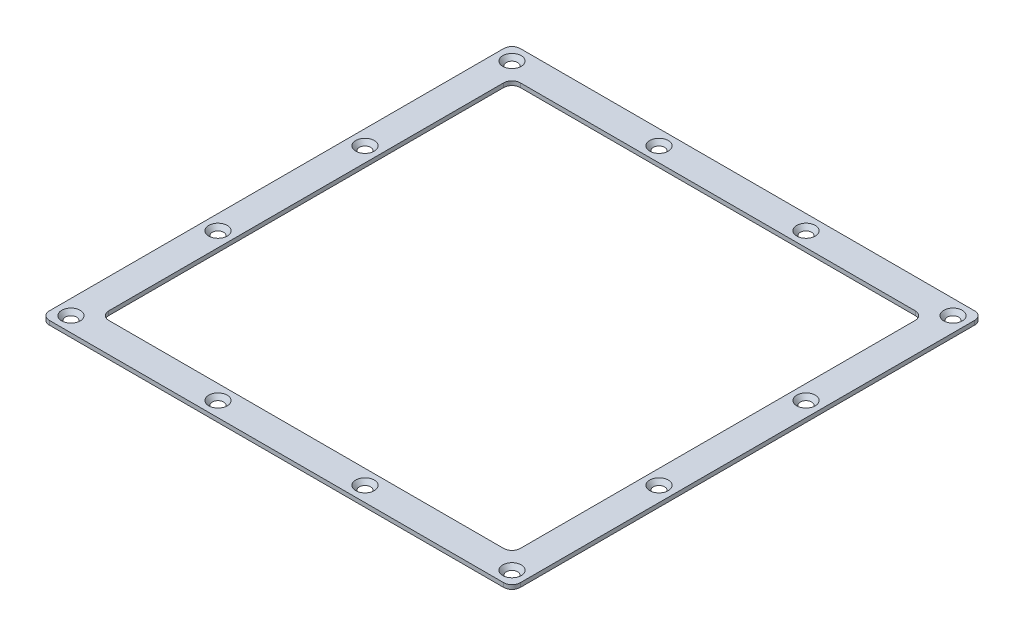
ISO-10303-21;
HEADER;
FILE_DESCRIPTION(('STEP AP214'),'2;1');
FILE_NAME('part.step','',(''),(''),'','','');
FILE_SCHEMA(('AUTOMOTIVE_DESIGN { 1 0 10303 214 1 1 1 1 }'));
ENDSEC;
DATA;
#1=APPLICATION_CONTEXT('core data for automotive mechanical design processes');
#2=APPLICATION_PROTOCOL_DEFINITION('international standard','automotive_design',2000,#1);
#3=PRODUCT_CONTEXT('',#1,'mechanical');
#4=PRODUCT('Part','Part','',(#3));
#5=PRODUCT_RELATED_PRODUCT_CATEGORY('part','',(#4));
#6=PRODUCT_DEFINITION_FORMATION('','',#4);
#7=PRODUCT_DEFINITION_CONTEXT('part definition',#1,'design');
#8=PRODUCT_DEFINITION('design','',#6,#7);
#9=PRODUCT_DEFINITION_SHAPE('','',#8);
#10=(LENGTH_UNIT() NAMED_UNIT(*) SI_UNIT(.MILLI.,.METRE.));
#11=(NAMED_UNIT(*) PLANE_ANGLE_UNIT() SI_UNIT($,.RADIAN.));
#12=(NAMED_UNIT(*) SI_UNIT($,.STERADIAN.) SOLID_ANGLE_UNIT());
#13=UNCERTAINTY_MEASURE_WITH_UNIT(LENGTH_MEASURE(1.E-05),#10,'distance_accuracy_value','');
#14=(GEOMETRIC_REPRESENTATION_CONTEXT(3) GLOBAL_UNCERTAINTY_ASSIGNED_CONTEXT((#13)) GLOBAL_UNIT_ASSIGNED_CONTEXT((#10,
#11,#12)) REPRESENTATION_CONTEXT('',''));
#15=CARTESIAN_POINT('',(0.,0.,0.));
#16=DIRECTION('',(0.,0.,1.));
#17=DIRECTION('',(1.,0.,0.));
#18=AXIS2_PLACEMENT_3D('',#15,#16,#17);
#19=CARTESIAN_POINT('',(177.038,-1.5875,-3.175));
#20=DIRECTION('',(0.,-1.,0.));
#21=DIRECTION('',(0.,0.,-1.));
#22=AXIS2_PLACEMENT_3D('',#19,#20,#21);
#23=PLANE('',#22);
#24=CARTESIAN_POINT('',(5.715,-1.5875,-174.4979492));
#25=DIRECTION('',(0.,-1.,0.));
#26=DIRECTION('',(0.,0.,-1.));
#27=AXIS2_PLACEMENT_3D('',#24,#25,#26);
#28=CIRCLE('',#27,2.16330730371674);
#29=CARTESIAN_POINT('',(5.715,-1.5875,-176.661256503717));
#30=VERTEX_POINT('',#29);
#31=EDGE_CURVE('E482',#30,#30,#28,.T.);
#32=ORIENTED_EDGE('',*,*,#31,.F.);
#33=EDGE_LOOP('',(#32));
#34=FACE_BOUND('',#33,.T.);
#35=CARTESIAN_POINT('',(61.976,-1.5875,-174.4979492));
#36=DIRECTION('',(0.,-1.,0.));
#37=DIRECTION('',(0.,0.,-1.));
#38=AXIS2_PLACEMENT_3D('',#35,#36,#37);
#39=CIRCLE('',#38,2.16330730371674);
#40=CARTESIAN_POINT('',(61.976,-1.5875,-176.661256503717));
#41=VERTEX_POINT('',#40);
#42=EDGE_CURVE('E478',#41,#41,#39,.T.);
#43=ORIENTED_EDGE('',*,*,#42,.F.);
#44=EDGE_LOOP('',(#43));
#45=FACE_BOUND('',#44,.T.);
#46=CARTESIAN_POINT('',(61.976,-1.5875,-5.7149492));
#47=DIRECTION('',(0.,-1.,0.));
#48=DIRECTION('',(0.,0.,-1.));
#49=AXIS2_PLACEMENT_3D('',#46,#47,#48);
#50=CIRCLE('',#49,2.16330730371674);
#51=CARTESIAN_POINT('',(61.976,-1.5875,-7.87825650371675));
#52=VERTEX_POINT('',#51);
#53=EDGE_CURVE('E474',#52,#52,#50,.T.);
#54=ORIENTED_EDGE('',*,*,#53,.F.);
#55=EDGE_LOOP('',(#54));
#56=FACE_BOUND('',#55,.T.);
#57=CARTESIAN_POINT('',(5.71500000000001,-1.5875,-5.7149492));
#58=DIRECTION('',(0.,-1.,0.));
#59=DIRECTION('',(0.,0.,-1.));
#60=AXIS2_PLACEMENT_3D('',#57,#58,#59);
#61=CIRCLE('',#60,2.16330730371674);
#62=CARTESIAN_POINT('',(5.71500000000001,-1.5875,-7.87825650371674));
#63=VERTEX_POINT('',#62);
#64=EDGE_CURVE('E470',#63,#63,#61,.T.);
#65=ORIENTED_EDGE('',*,*,#64,.F.);
#66=EDGE_LOOP('',(#65));
#67=FACE_BOUND('',#66,.T.);
#68=CARTESIAN_POINT('',(174.498,-1.5875,-61.9759492));
#69=DIRECTION('',(0.,-1.,0.));
#70=DIRECTION('',(0.,0.,-1.));
#71=AXIS2_PLACEMENT_3D('',#68,#69,#70);
#72=CIRCLE('',#71,2.16330730371673);
#73=CARTESIAN_POINT('',(174.498,-1.5875,-64.1392565037167));
#74=VERTEX_POINT('',#73);
#75=EDGE_CURVE('E446',#74,#74,#72,.T.);
#76=ORIENTED_EDGE('',*,*,#75,.F.);
#77=EDGE_LOOP('',(#76));
#78=FACE_BOUND('',#77,.T.);
#79=CARTESIAN_POINT('',(118.237,-1.5875,-5.7149492));
#80=DIRECTION('',(0.,-1.,0.));
#81=DIRECTION('',(0.,0.,-1.));
#82=AXIS2_PLACEMENT_3D('',#79,#80,#81);
#83=CIRCLE('',#82,2.16330730371674);
#84=CARTESIAN_POINT('',(118.237,-1.5875,-7.87825650371675));
#85=VERTEX_POINT('',#84);
#86=EDGE_CURVE('E441',#85,#85,#83,.T.);
#87=ORIENTED_EDGE('',*,*,#86,.F.);
#88=EDGE_LOOP('',(#87));
#89=FACE_BOUND('',#88,.T.);
#90=CARTESIAN_POINT('',(174.498,-1.5875,-5.7149492));
#91=DIRECTION('',(0.,-1.,0.));
#92=DIRECTION('',(0.,0.,-1.));
#93=AXIS2_PLACEMENT_3D('',#90,#91,#92);
#94=CIRCLE('',#93,2.16330730371673);
#95=CARTESIAN_POINT('',(174.498,-1.5875,-7.87825650371673));
#96=VERTEX_POINT('',#95);
#97=EDGE_CURVE('E179',#96,#96,#94,.T.);
#98=ORIENTED_EDGE('',*,*,#97,.F.);
#99=EDGE_LOOP('',(#98));
#100=FACE_BOUND('',#99,.T.);
#101=CARTESIAN_POINT('',(177.038,-1.5875,-3.175));
#102=DIRECTION('',(0.,1.,0.));
#103=DIRECTION('',(0.,0.,-1.));
#104=AXIS2_PLACEMENT_3D('',#101,#102,#103);
#105=CIRCLE('',#104,3.17500000000001);
#106=CARTESIAN_POINT('',(177.038,-1.5875,0.));
#107=VERTEX_POINT('',#106);
#108=CARTESIAN_POINT('',(180.213,-1.5875,-3.175));
#109=VERTEX_POINT('',#108);
#110=EDGE_CURVE('E226',#107,#109,#105,.T.);
#111=ORIENTED_EDGE('',*,*,#110,.F.);
#112=DIRECTION('',(1.,0.,0.));
#113=VECTOR('',#112,1.);
#114=CARTESIAN_POINT('',(3.17500000000002,-1.5875,0.));
#115=LINE('',#114,#113);
#116=CARTESIAN_POINT('',(3.17500000000002,-1.5875,0.));
#117=VERTEX_POINT('',#116);
#118=EDGE_CURVE('E248',#117,#107,#115,.T.);
#119=ORIENTED_EDGE('',*,*,#118,.F.);
#120=CARTESIAN_POINT('',(3.175,-1.5875,-3.175));
#121=DIRECTION('',(0.,1.,0.));
#122=DIRECTION('',(0.,0.,-1.));
#123=AXIS2_PLACEMENT_3D('',#120,#121,#122);
#124=CIRCLE('',#123,3.175);
#125=CARTESIAN_POINT('',(0.,-1.5875,-3.17500000000002));
#126=VERTEX_POINT('',#125);
#127=EDGE_CURVE('E245',#126,#117,#124,.T.);
#128=ORIENTED_EDGE('',*,*,#127,.F.);
#129=DIRECTION('',(0.,0.,1.));
#130=VECTOR('',#129,1.);
#131=CARTESIAN_POINT('',(0.,-1.5875,-3.17500000000002));
#132=LINE('',#131,#130);
#133=CARTESIAN_POINT('',(0.,-1.5875,-177.038));
#134=VERTEX_POINT('',#133);
#135=EDGE_CURVE('E242',#134,#126,#132,.T.);
#136=ORIENTED_EDGE('',*,*,#135,.F.);
#137=CARTESIAN_POINT('',(3.175,-1.5875,-177.038));
#138=DIRECTION('',(0.,1.,0.));
#139=DIRECTION('',(0.,0.,1.));
#140=AXIS2_PLACEMENT_3D('',#137,#138,#139);
#141=CIRCLE('',#140,3.17500000000001);
#142=CARTESIAN_POINT('',(3.175,-1.5875,-180.213));
#143=VERTEX_POINT('',#142);
#144=EDGE_CURVE('E239',#143,#134,#141,.T.);
#145=ORIENTED_EDGE('',*,*,#144,.F.);
#146=DIRECTION('',(-1.,0.,0.));
#147=VECTOR('',#146,1.);
#148=CARTESIAN_POINT('',(3.175,-1.5875,-180.213));
#149=LINE('',#148,#147);
#150=CARTESIAN_POINT('',(177.038,-1.5875,-180.213));
#151=VERTEX_POINT('',#150);
#152=EDGE_CURVE('E236',#151,#143,#149,.T.);
#153=ORIENTED_EDGE('',*,*,#152,.F.);
#154=CARTESIAN_POINT('',(177.038,-1.5875,-177.038));
#155=DIRECTION('',(0.,1.,0.));
#156=DIRECTION('',(0.,0.,1.));
#157=AXIS2_PLACEMENT_3D('',#154,#155,#156);
#158=CIRCLE('',#157,3.17500000000001);
#159=CARTESIAN_POINT('',(180.213,-1.5875,-177.038));
#160=VERTEX_POINT('',#159);
#161=EDGE_CURVE('E233',#160,#151,#158,.T.);
#162=ORIENTED_EDGE('',*,*,#161,.F.);
#163=DIRECTION('',(0.,0.,-1.));
#164=VECTOR('',#163,1.);
#165=CARTESIAN_POINT('',(180.213,-1.5875,-3.175));
#166=LINE('',#165,#164);
#167=EDGE_CURVE('E229',#109,#160,#166,.T.);
#168=ORIENTED_EDGE('',*,*,#167,.F.);
#169=EDGE_LOOP('',(#111,#119,#128,#136,#145,#153,#162,#168));
#170=FACE_BOUND('',#169,.T.);
#171=CARTESIAN_POINT('',(14.5288,-1.5875,-165.6842));
#172=DIRECTION('',(0.,1.,0.));
#173=DIRECTION('',(0.,0.,1.));
#174=AXIS2_PLACEMENT_3D('',#171,#172,#173);
#175=CIRCLE('',#174,3.17500000000001);
#176=CARTESIAN_POINT('',(14.5288,-1.5875,-168.8592));
#177=VERTEX_POINT('',#176);
#178=CARTESIAN_POINT('',(11.3538,-1.5875,-165.6842));
#179=VERTEX_POINT('',#178);
#180=EDGE_CURVE('E157',#177,#179,#175,.T.);
#181=ORIENTED_EDGE('',*,*,#180,.T.);
#182=DIRECTION('',(0.,0.,1.));
#183=VECTOR('',#182,1.);
#184=CARTESIAN_POINT('',(11.3538,-1.5875,-165.6842));
#185=LINE('',#184,#183);
#186=CARTESIAN_POINT('',(11.3538,-1.5875,-14.5288));
#187=VERTEX_POINT('',#186);
#188=EDGE_CURVE('E166',#179,#187,#185,.T.);
#189=ORIENTED_EDGE('',*,*,#188,.T.);
#190=CARTESIAN_POINT('',(14.5288,-1.5875,-14.5288));
#191=DIRECTION('',(0.,1.,0.));
#192=DIRECTION('',(0.,0.,1.));
#193=AXIS2_PLACEMENT_3D('',#190,#191,#192);
#194=CIRCLE('',#193,3.175);
#195=CARTESIAN_POINT('',(14.5288,-1.5875,-11.3538));
#196=VERTEX_POINT('',#195);
#197=EDGE_CURVE('E58',#187,#196,#194,.T.);
#198=ORIENTED_EDGE('',*,*,#197,.T.);
#199=DIRECTION('',(1.,0.,0.));
#200=VECTOR('',#199,1.);
#201=CARTESIAN_POINT('',(14.5288,-1.5875,-11.3538));
#202=LINE('',#201,#200);
#203=CARTESIAN_POINT('',(165.6842,-1.5875,-11.3538));
#204=VERTEX_POINT('',#203);
#205=EDGE_CURVE('E183',#196,#204,#202,.T.);
#206=ORIENTED_EDGE('',*,*,#205,.T.);
#207=CARTESIAN_POINT('',(165.6842,-1.5875,-14.5288));
#208=DIRECTION('',(0.,1.,0.));
#209=DIRECTION('',(0.,0.,1.));
#210=AXIS2_PLACEMENT_3D('',#207,#208,#209);
#211=CIRCLE('',#210,3.17500000000002);
#212=CARTESIAN_POINT('',(168.8592,-1.5875,-14.5288));
#213=VERTEX_POINT('',#212);
#214=EDGE_CURVE('E186',#204,#213,#211,.T.);
#215=ORIENTED_EDGE('',*,*,#214,.T.);
#216=DIRECTION('',(0.,0.,-1.));
#217=VECTOR('',#216,1.);
#218=CARTESIAN_POINT('',(168.8592,-1.5875,-165.6842));
#219=LINE('',#218,#217);
#220=CARTESIAN_POINT('',(168.8592,-1.5875,-165.6842));
#221=VERTEX_POINT('',#220);
#222=EDGE_CURVE('E189',#213,#221,#219,.T.);
#223=ORIENTED_EDGE('',*,*,#222,.T.);
#224=CARTESIAN_POINT('',(165.6842,-1.5875,-165.6842));
#225=DIRECTION('',(0.,1.,0.));
#226=DIRECTION('',(0.,0.,-1.));
#227=AXIS2_PLACEMENT_3D('',#224,#225,#226);
#228=CIRCLE('',#227,3.17500000000001);
#229=CARTESIAN_POINT('',(165.6842,-1.5875,-168.8592));
#230=VERTEX_POINT('',#229);
#231=EDGE_CURVE('E192',#221,#230,#228,.T.);
#232=ORIENTED_EDGE('',*,*,#231,.T.);
#233=DIRECTION('',(-1.,0.,0.));
#234=VECTOR('',#233,1.);
#235=CARTESIAN_POINT('',(14.5288,-1.5875,-168.8592));
#236=LINE('',#235,#234);
#237=EDGE_CURVE('E163',#230,#177,#236,.T.);
#238=ORIENTED_EDGE('',*,*,#237,.T.);
#239=EDGE_LOOP('',(#181,#189,#198,#206,#215,#223,#232,#238));
#240=FACE_BOUND('',#239,.T.);
#241=CARTESIAN_POINT('',(174.498,-1.5875,-118.2369492));
#242=DIRECTION('',(0.,-1.,0.));
#243=DIRECTION('',(0.,0.,-1.));
#244=AXIS2_PLACEMENT_3D('',#241,#242,#243);
#245=CIRCLE('',#244,2.16330730371673);
#246=CARTESIAN_POINT('',(174.498,-1.5875,-120.400256503717));
#247=VERTEX_POINT('',#246);
#248=EDGE_CURVE('E450',#247,#247,#245,.T.);
#249=ORIENTED_EDGE('',*,*,#248,.F.);
#250=EDGE_LOOP('',(#249));
#251=FACE_BOUND('',#250,.T.);
#252=CARTESIAN_POINT('',(174.498,-1.5875,-174.4979492));
#253=DIRECTION('',(0.,-1.,0.));
#254=DIRECTION('',(0.,0.,-1.));
#255=AXIS2_PLACEMENT_3D('',#252,#253,#254);
#256=CIRCLE('',#255,2.16330730371673);
#257=CARTESIAN_POINT('',(174.498,-1.5875,-176.661256503717));
#258=VERTEX_POINT('',#257);
#259=EDGE_CURVE('E454',#258,#258,#256,.T.);
#260=ORIENTED_EDGE('',*,*,#259,.F.);
#261=EDGE_LOOP('',(#260));
#262=FACE_BOUND('',#261,.T.);
#263=CARTESIAN_POINT('',(118.237,-1.5875,-174.4979492));
#264=DIRECTION('',(0.,-1.,0.));
#265=DIRECTION('',(0.,0.,-1.));
#266=AXIS2_PLACEMENT_3D('',#263,#264,#265);
#267=CIRCLE('',#266,2.16330730371674);
#268=CARTESIAN_POINT('',(118.237,-1.5875,-176.661256503717));
#269=VERTEX_POINT('',#268);
#270=EDGE_CURVE('E458',#269,#269,#267,.T.);
#271=ORIENTED_EDGE('',*,*,#270,.F.);
#272=EDGE_LOOP('',(#271));
#273=FACE_BOUND('',#272,.T.);
#274=CARTESIAN_POINT('',(5.71500000000001,-1.5875,-118.2369492));
#275=DIRECTION('',(0.,-1.,0.));
#276=DIRECTION('',(0.,0.,-1.));
#277=AXIS2_PLACEMENT_3D('',#274,#275,#276);
#278=CIRCLE('',#277,2.16330730371674);
#279=CARTESIAN_POINT('',(5.71500000000001,-1.5875,-120.400256503717));
#280=VERTEX_POINT('',#279);
#281=EDGE_CURVE('E462',#280,#280,#278,.T.);
#282=ORIENTED_EDGE('',*,*,#281,.F.);
#283=EDGE_LOOP('',(#282));
#284=FACE_BOUND('',#283,.T.);
#285=CARTESIAN_POINT('',(5.71499999999999,-1.5875,-61.9759492));
#286=DIRECTION('',(0.,-1.,0.));
#287=DIRECTION('',(0.,0.,-1.));
#288=AXIS2_PLACEMENT_3D('',#285,#286,#287);
#289=CIRCLE('',#288,2.16330730371674);
#290=CARTESIAN_POINT('',(5.71499999999999,-1.5875,-64.1392565037167));
#291=VERTEX_POINT('',#290);
#292=EDGE_CURVE('E466',#291,#291,#289,.T.);
#293=ORIENTED_EDGE('',*,*,#292,.F.);
#294=EDGE_LOOP('',(#293));
#295=FACE_BOUND('',#294,.T.);
#296=ADVANCED_FACE('F41',(#34,#45,#56,#67,#78,#89,#100,#170,#240,#251,#262,#273,#284,#295),#23,.T.);
#297=CARTESIAN_POINT('',(177.038,-1.5875,-3.175));
#298=DIRECTION('',(0.,1.,0.));
#299=DIRECTION('',(0.,0.,1.));
#300=AXIS2_PLACEMENT_3D('',#297,#298,#299);
#301=CYLINDRICAL_SURFACE('',#300,3.17500000000001);
#302=CARTESIAN_POINT('',(177.038,0.,-3.175));
#303=DIRECTION('',(0.,1.,0.));
#304=DIRECTION('',(0.,0.,-1.));
#305=AXIS2_PLACEMENT_3D('',#302,#303,#304);
#306=CIRCLE('',#305,3.17500000000001);
#307=CARTESIAN_POINT('',(177.038,0.,0.));
#308=VERTEX_POINT('',#307);
#309=CARTESIAN_POINT('',(180.213,0.,-3.175));
#310=VERTEX_POINT('',#309);
#311=EDGE_CURVE('E214',#308,#310,#306,.T.);
#312=ORIENTED_EDGE('',*,*,#311,.F.);
#313=DIRECTION('',(0.,1.,0.));
#314=VECTOR('',#313,1.);
#315=CARTESIAN_POINT('',(177.038,-1.5875,0.));
#316=LINE('',#315,#314);
#317=EDGE_CURVE('E11',#107,#308,#316,.T.);
#318=ORIENTED_EDGE('',*,*,#317,.F.);
#319=ORIENTED_EDGE('',*,*,#110,.T.);
#320=DIRECTION('',(0.,1.,0.));
#321=VECTOR('',#320,1.);
#322=CARTESIAN_POINT('',(180.213,-1.5875,-3.175));
#323=LINE('',#322,#321);
#324=EDGE_CURVE('E45',#109,#310,#323,.T.);
#325=ORIENTED_EDGE('',*,*,#324,.T.);
#326=EDGE_LOOP('',(#312,#318,#319,#325));
#327=FACE_BOUND('',#326,.T.);
#328=ADVANCED_FACE('F43',(#327),#301,.T.);
#329=CARTESIAN_POINT('',(3.17500000000002,-1.5875,0.));
#330=DIRECTION('',(0.,0.,1.));
#331=DIRECTION('',(1.,0.,0.));
#332=AXIS2_PLACEMENT_3D('',#329,#330,#331);
#333=PLANE('',#332);
#334=DIRECTION('',(1.,0.,0.));
#335=VECTOR('',#334,1.);
#336=CARTESIAN_POINT('',(3.17500000000002,0.,0.));
#337=LINE('',#336,#335);
#338=CARTESIAN_POINT('',(3.17500000000002,0.,0.));
#339=VERTEX_POINT('',#338);
#340=EDGE_CURVE('E230',#339,#308,#337,.T.);
#341=ORIENTED_EDGE('',*,*,#340,.F.);
#342=DIRECTION('',(0.,1.,0.));
#343=VECTOR('',#342,1.);
#344=CARTESIAN_POINT('',(3.17500000000002,-1.5875,0.));
#345=LINE('',#344,#343);
#346=EDGE_CURVE('E50',#117,#339,#345,.T.);
#347=ORIENTED_EDGE('',*,*,#346,.F.);
#348=ORIENTED_EDGE('',*,*,#118,.T.);
#349=ORIENTED_EDGE('',*,*,#317,.T.);
#350=EDGE_LOOP('',(#341,#347,#348,#349));
#351=FACE_BOUND('',#350,.T.);
#352=ADVANCED_FACE('F295',(#351),#333,.T.);
#353=CARTESIAN_POINT('',(3.175,-1.5875,-3.175));
#354=DIRECTION('',(0.,1.,0.));
#355=DIRECTION('',(0.,0.,1.));
#356=AXIS2_PLACEMENT_3D('',#353,#354,#355);
#357=CYLINDRICAL_SURFACE('',#356,3.175);
#358=CARTESIAN_POINT('',(3.175,0.,-3.175));
#359=DIRECTION('',(0.,1.,0.));
#360=DIRECTION('',(0.,0.,-1.));
#361=AXIS2_PLACEMENT_3D('',#358,#359,#360);
#362=CIRCLE('',#361,3.175);
#363=CARTESIAN_POINT('',(0.,0.,-3.17500000000002));
#364=VERTEX_POINT('',#363);
#365=EDGE_CURVE('E268',#364,#339,#362,.T.);
#366=ORIENTED_EDGE('',*,*,#365,.F.);
#367=DIRECTION('',(0.,1.,0.));
#368=VECTOR('',#367,1.);
#369=CARTESIAN_POINT('',(0.,-1.5875,-3.17500000000002));
#370=LINE('',#369,#368);
#371=EDGE_CURVE('E274',#126,#364,#370,.T.);
#372=ORIENTED_EDGE('',*,*,#371,.F.);
#373=ORIENTED_EDGE('',*,*,#127,.T.);
#374=ORIENTED_EDGE('',*,*,#346,.T.);
#375=EDGE_LOOP('',(#366,#372,#373,#374));
#376=FACE_BOUND('',#375,.T.);
#377=ADVANCED_FACE('F315',(#376),#357,.T.);
#378=CARTESIAN_POINT('',(0.,-1.5875,-3.17500000000002));
#379=DIRECTION('',(-1.,0.,0.));
#380=DIRECTION('',(0.,0.,1.));
#381=AXIS2_PLACEMENT_3D('',#378,#379,#380);
#382=PLANE('',#381);
#383=DIRECTION('',(0.,0.,1.));
#384=VECTOR('',#383,1.);
#385=CARTESIAN_POINT('',(0.,0.,-3.17500000000002));
#386=LINE('',#385,#384);
#387=CARTESIAN_POINT('',(0.,0.,-177.038));
#388=VERTEX_POINT('',#387);
#389=EDGE_CURVE('E265',#388,#364,#386,.T.);
#390=ORIENTED_EDGE('',*,*,#389,.F.);
#391=DIRECTION('',(0.,1.,0.));
#392=VECTOR('',#391,1.);
#393=CARTESIAN_POINT('',(0.,-1.5875,-177.038));
#394=LINE('',#393,#392);
#395=EDGE_CURVE('E276',#134,#388,#394,.T.);
#396=ORIENTED_EDGE('',*,*,#395,.F.);
#397=ORIENTED_EDGE('',*,*,#135,.T.);
#398=ORIENTED_EDGE('',*,*,#371,.T.);
#399=EDGE_LOOP('',(#390,#396,#397,#398));
#400=FACE_BOUND('',#399,.T.);
#401=ADVANCED_FACE('F313',(#400),#382,.T.);
#402=CARTESIAN_POINT('',(3.175,-1.5875,-177.038));
#403=DIRECTION('',(0.,1.,0.));
#404=DIRECTION('',(0.,0.,1.));
#405=AXIS2_PLACEMENT_3D('',#402,#403,#404);
#406=CYLINDRICAL_SURFACE('',#405,3.17500000000001);
#407=CARTESIAN_POINT('',(3.175,0.,-177.038));
#408=DIRECTION('',(0.,1.,0.));
#409=DIRECTION('',(0.,0.,1.));
#410=AXIS2_PLACEMENT_3D('',#407,#408,#409);
#411=CIRCLE('',#410,3.17500000000001);
#412=CARTESIAN_POINT('',(3.175,0.,-180.213));
#413=VERTEX_POINT('',#412);
#414=EDGE_CURVE('E262',#413,#388,#411,.T.);
#415=ORIENTED_EDGE('',*,*,#414,.F.);
#416=DIRECTION('',(0.,1.,0.));
#417=VECTOR('',#416,1.);
#418=CARTESIAN_POINT('',(3.175,-1.5875,-180.213));
#419=LINE('',#418,#417);
#420=EDGE_CURVE('E278',#143,#413,#419,.T.);
#421=ORIENTED_EDGE('',*,*,#420,.F.);
#422=ORIENTED_EDGE('',*,*,#144,.T.);
#423=ORIENTED_EDGE('',*,*,#395,.T.);
#424=EDGE_LOOP('',(#415,#421,#422,#423));
#425=FACE_BOUND('',#424,.T.);
#426=ADVANCED_FACE('F309',(#425),#406,.T.);
#427=CARTESIAN_POINT('',(3.175,-1.5875,-180.213));
#428=DIRECTION('',(0.,0.,-1.));
#429=DIRECTION('',(-1.,0.,0.));
#430=AXIS2_PLACEMENT_3D('',#427,#428,#429);
#431=PLANE('',#430);
#432=DIRECTION('',(-1.,0.,0.));
#433=VECTOR('',#432,1.);
#434=CARTESIAN_POINT('',(3.175,0.,-180.213));
#435=LINE('',#434,#433);
#436=CARTESIAN_POINT('',(177.038,0.,-180.213));
#437=VERTEX_POINT('',#436);
#438=EDGE_CURVE('E259',#437,#413,#435,.T.);
#439=ORIENTED_EDGE('',*,*,#438,.F.);
#440=DIRECTION('',(0.,1.,0.));
#441=VECTOR('',#440,1.);
#442=CARTESIAN_POINT('',(177.038,-1.5875,-180.213));
#443=LINE('',#442,#441);
#444=EDGE_CURVE('E280',#151,#437,#443,.T.);
#445=ORIENTED_EDGE('',*,*,#444,.F.);
#446=ORIENTED_EDGE('',*,*,#152,.T.);
#447=ORIENTED_EDGE('',*,*,#420,.T.);
#448=EDGE_LOOP('',(#439,#445,#446,#447));
#449=FACE_BOUND('',#448,.T.);
#450=ADVANCED_FACE('F307',(#449),#431,.T.);
#451=CARTESIAN_POINT('',(177.038,-1.5875,-177.038));
#452=DIRECTION('',(0.,1.,0.));
#453=DIRECTION('',(0.,0.,1.));
#454=AXIS2_PLACEMENT_3D('',#451,#452,#453);
#455=CYLINDRICAL_SURFACE('',#454,3.17500000000001);
#456=CARTESIAN_POINT('',(177.038,0.,-177.038));
#457=DIRECTION('',(0.,1.,0.));
#458=DIRECTION('',(0.,0.,1.));
#459=AXIS2_PLACEMENT_3D('',#456,#457,#458);
#460=CIRCLE('',#459,3.17500000000001);
#461=CARTESIAN_POINT('',(180.213,0.,-177.038));
#462=VERTEX_POINT('',#461);
#463=EDGE_CURVE('E256',#462,#437,#460,.T.);
#464=ORIENTED_EDGE('',*,*,#463,.F.);
#465=DIRECTION('',(0.,1.,0.));
#466=VECTOR('',#465,1.);
#467=CARTESIAN_POINT('',(180.213,-1.5875,-177.038));
#468=LINE('',#467,#466);
#469=EDGE_CURVE('E281',#160,#462,#468,.T.);
#470=ORIENTED_EDGE('',*,*,#469,.F.);
#471=ORIENTED_EDGE('',*,*,#161,.T.);
#472=ORIENTED_EDGE('',*,*,#444,.T.);
#473=EDGE_LOOP('',(#464,#470,#471,#472));
#474=FACE_BOUND('',#473,.T.);
#475=ADVANCED_FACE('F303',(#474),#455,.T.);
#476=CARTESIAN_POINT('',(180.213,-1.5875,-3.175));
#477=DIRECTION('',(1.,0.,0.));
#478=DIRECTION('',(0.,0.,-1.));
#479=AXIS2_PLACEMENT_3D('',#476,#477,#478);
#480=PLANE('',#479);
#481=DIRECTION('',(0.,0.,-1.));
#482=VECTOR('',#481,1.);
#483=CARTESIAN_POINT('',(180.213,0.,-3.175));
#484=LINE('',#483,#482);
#485=EDGE_CURVE('E253',#310,#462,#484,.T.);
#486=ORIENTED_EDGE('',*,*,#485,.F.);
#487=ORIENTED_EDGE('',*,*,#324,.F.);
#488=ORIENTED_EDGE('',*,*,#167,.T.);
#489=ORIENTED_EDGE('',*,*,#469,.T.);
#490=EDGE_LOOP('',(#486,#487,#488,#489));
#491=FACE_BOUND('',#490,.T.);
#492=ADVANCED_FACE('F289',(#491),#480,.T.);
#493=CARTESIAN_POINT('',(177.038,0.,-3.175));
#494=DIRECTION('',(0.,-1.,0.));
#495=DIRECTION('',(0.,0.,-1.));
#496=AXIS2_PLACEMENT_3D('',#493,#494,#495);
#497=PLANE('',#496);
#498=CARTESIAN_POINT('',(5.715,0.,-174.4979492));
#499=DIRECTION('',(0.,1.,0.));
#500=DIRECTION('',(0.,0.,1.));
#501=AXIS2_PLACEMENT_3D('',#498,#499,#500);
#502=CIRCLE('',#501,3.5433);
#503=CARTESIAN_POINT('',(5.715,0.,-170.9546492));
#504=VERTEX_POINT('',#503);
#505=EDGE_CURVE('E345',#504,#504,#502,.T.);
#506=ORIENTED_EDGE('',*,*,#505,.F.);
#507=EDGE_LOOP('',(#506));
#508=FACE_BOUND('',#507,.T.);
#509=CARTESIAN_POINT('',(61.976,0.,-174.4979492));
#510=DIRECTION('',(0.,1.,0.));
#511=DIRECTION('',(0.,0.,1.));
#512=AXIS2_PLACEMENT_3D('',#509,#510,#511);
#513=CIRCLE('',#512,3.5433);
#514=CARTESIAN_POINT('',(61.976,0.,-170.9546492));
#515=VERTEX_POINT('',#514);
#516=EDGE_CURVE('E349',#515,#515,#513,.T.);
#517=ORIENTED_EDGE('',*,*,#516,.F.);
#518=EDGE_LOOP('',(#517));
#519=FACE_BOUND('',#518,.T.);
#520=CARTESIAN_POINT('',(61.976,0.,-5.7149492));
#521=DIRECTION('',(0.,1.,0.));
#522=DIRECTION('',(0.,0.,1.));
#523=AXIS2_PLACEMENT_3D('',#520,#521,#522);
#524=CIRCLE('',#523,3.5433);
#525=CARTESIAN_POINT('',(61.976,0.,-2.17164920000001));
#526=VERTEX_POINT('',#525);
#527=EDGE_CURVE('E353',#526,#526,#524,.T.);
#528=ORIENTED_EDGE('',*,*,#527,.F.);
#529=EDGE_LOOP('',(#528));
#530=FACE_BOUND('',#529,.T.);
#531=CARTESIAN_POINT('',(5.71500000000001,0.,-5.7149492));
#532=DIRECTION('',(0.,1.,0.));
#533=DIRECTION('',(0.,0.,1.));
#534=AXIS2_PLACEMENT_3D('',#531,#532,#533);
#535=CIRCLE('',#534,3.5433);
#536=CARTESIAN_POINT('',(5.71500000000001,0.,-2.1716492));
#537=VERTEX_POINT('',#536);
#538=EDGE_CURVE('E357',#537,#537,#535,.T.);
#539=ORIENTED_EDGE('',*,*,#538,.F.);
#540=EDGE_LOOP('',(#539));
#541=FACE_BOUND('',#540,.T.);
#542=CARTESIAN_POINT('',(5.71499999999999,0.,-61.9759492));
#543=DIRECTION('',(0.,1.,0.));
#544=DIRECTION('',(0.,0.,1.));
#545=AXIS2_PLACEMENT_3D('',#542,#543,#544);
#546=CIRCLE('',#545,3.5433);
#547=CARTESIAN_POINT('',(5.71499999999999,0.,-58.4326492));
#548=VERTEX_POINT('',#547);
#549=EDGE_CURVE('E361',#548,#548,#546,.T.);
#550=ORIENTED_EDGE('',*,*,#549,.F.);
#551=EDGE_LOOP('',(#550));
#552=FACE_BOUND('',#551,.T.);
#553=CARTESIAN_POINT('',(5.71500000000001,0.,-118.2369492));
#554=DIRECTION('',(0.,1.,0.));
#555=DIRECTION('',(0.,0.,1.));
#556=AXIS2_PLACEMENT_3D('',#553,#554,#555);
#557=CIRCLE('',#556,3.5433);
#558=CARTESIAN_POINT('',(5.71500000000001,0.,-114.6936492));
#559=VERTEX_POINT('',#558);
#560=EDGE_CURVE('E365',#559,#559,#557,.T.);
#561=ORIENTED_EDGE('',*,*,#560,.F.);
#562=EDGE_LOOP('',(#561));
#563=FACE_BOUND('',#562,.T.);
#564=CARTESIAN_POINT('',(118.237,0.,-174.4979492));
#565=DIRECTION('',(0.,1.,0.));
#566=DIRECTION('',(0.,0.,1.));
#567=AXIS2_PLACEMENT_3D('',#564,#565,#566);
#568=CIRCLE('',#567,3.5433);
#569=CARTESIAN_POINT('',(118.237,0.,-170.9546492));
#570=VERTEX_POINT('',#569);
#571=EDGE_CURVE('E369',#570,#570,#568,.T.);
#572=ORIENTED_EDGE('',*,*,#571,.F.);
#573=EDGE_LOOP('',(#572));
#574=FACE_BOUND('',#573,.T.);
#575=CARTESIAN_POINT('',(174.498,0.,-174.4979492));
#576=DIRECTION('',(0.,1.,0.));
#577=DIRECTION('',(0.,0.,1.));
#578=AXIS2_PLACEMENT_3D('',#575,#576,#577);
#579=CIRCLE('',#578,3.5433);
#580=CARTESIAN_POINT('',(174.498,0.,-170.9546492));
#581=VERTEX_POINT('',#580);
#582=EDGE_CURVE('E373',#581,#581,#579,.T.);
#583=ORIENTED_EDGE('',*,*,#582,.F.);
#584=EDGE_LOOP('',(#583));
#585=FACE_BOUND('',#584,.T.);
#586=CARTESIAN_POINT('',(174.498,0.,-118.2369492));
#587=DIRECTION('',(0.,1.,0.));
#588=DIRECTION('',(0.,0.,1.));
#589=AXIS2_PLACEMENT_3D('',#586,#587,#588);
#590=CIRCLE('',#589,3.5433);
#591=CARTESIAN_POINT('',(174.498,0.,-114.6936492));
#592=VERTEX_POINT('',#591);
#593=EDGE_CURVE('E377',#592,#592,#590,.T.);
#594=ORIENTED_EDGE('',*,*,#593,.F.);
#595=EDGE_LOOP('',(#594));
#596=FACE_BOUND('',#595,.T.);
#597=CARTESIAN_POINT('',(174.498,0.,-61.9759492));
#598=DIRECTION('',(0.,1.,0.));
#599=DIRECTION('',(0.,0.,1.));
#600=AXIS2_PLACEMENT_3D('',#597,#598,#599);
#601=CIRCLE('',#600,3.5433);
#602=CARTESIAN_POINT('',(174.498,0.,-58.4326492));
#603=VERTEX_POINT('',#602);
#604=EDGE_CURVE('E381',#603,#603,#601,.T.);
#605=ORIENTED_EDGE('',*,*,#604,.F.);
#606=EDGE_LOOP('',(#605));
#607=FACE_BOUND('',#606,.T.);
#608=CARTESIAN_POINT('',(118.237,0.,-5.7149492));
#609=DIRECTION('',(0.,1.,0.));
#610=DIRECTION('',(0.,0.,1.));
#611=AXIS2_PLACEMENT_3D('',#608,#609,#610);
#612=CIRCLE('',#611,3.5433);
#613=CARTESIAN_POINT('',(118.237,0.,-2.17164920000001));
#614=VERTEX_POINT('',#613);
#615=EDGE_CURVE('E385',#614,#614,#612,.T.);
#616=ORIENTED_EDGE('',*,*,#615,.F.);
#617=EDGE_LOOP('',(#616));
#618=FACE_BOUND('',#617,.T.);
#619=CARTESIAN_POINT('',(174.498,0.,-5.7149492));
#620=DIRECTION('',(0.,1.,0.));
#621=DIRECTION('',(0.,0.,1.));
#622=AXIS2_PLACEMENT_3D('',#619,#620,#621);
#623=CIRCLE('',#622,3.5433);
#624=CARTESIAN_POINT('',(174.498,0.,-2.1716492));
#625=VERTEX_POINT('',#624);
#626=EDGE_CURVE('E389',#625,#625,#623,.T.);
#627=ORIENTED_EDGE('',*,*,#626,.F.);
#628=EDGE_LOOP('',(#627));
#629=FACE_BOUND('',#628,.T.);
#630=DIRECTION('',(0.,0.,1.));
#631=VECTOR('',#630,1.);
#632=CARTESIAN_POINT('',(11.3538,0.,-165.6842));
#633=LINE('',#632,#631);
#634=CARTESIAN_POINT('',(11.3538,0.,-165.6842));
#635=VERTEX_POINT('',#634);
#636=CARTESIAN_POINT('',(11.3538,0.,-14.5288));
#637=VERTEX_POINT('',#636);
#638=EDGE_CURVE('E196',#635,#637,#633,.T.);
#639=ORIENTED_EDGE('',*,*,#638,.F.);
#640=CARTESIAN_POINT('',(14.5288,0.,-165.6842));
#641=DIRECTION('',(0.,1.,0.));
#642=DIRECTION('',(0.,0.,1.));
#643=AXIS2_PLACEMENT_3D('',#640,#641,#642);
#644=CIRCLE('',#643,3.17500000000001);
#645=CARTESIAN_POINT('',(14.5288,0.,-168.8592));
#646=VERTEX_POINT('',#645);
#647=EDGE_CURVE('E66',#646,#635,#644,.T.);
#648=ORIENTED_EDGE('',*,*,#647,.F.);
#649=DIRECTION('',(-1.,0.,0.));
#650=VECTOR('',#649,1.);
#651=CARTESIAN_POINT('',(14.5288,0.,-168.8592));
#652=LINE('',#651,#650);
#653=CARTESIAN_POINT('',(165.6842,0.,-168.8592));
#654=VERTEX_POINT('',#653);
#655=EDGE_CURVE('E173',#654,#646,#652,.T.);
#656=ORIENTED_EDGE('',*,*,#655,.F.);
#657=CARTESIAN_POINT('',(165.6842,0.,-165.6842));
#658=DIRECTION('',(0.,1.,0.));
#659=DIRECTION('',(0.,0.,-1.));
#660=AXIS2_PLACEMENT_3D('',#657,#658,#659);
#661=CIRCLE('',#660,3.17500000000001);
#662=CARTESIAN_POINT('',(168.8592,0.,-165.6842));
#663=VERTEX_POINT('',#662);
#664=EDGE_CURVE('E176',#663,#654,#661,.T.);
#665=ORIENTED_EDGE('',*,*,#664,.F.);
#666=DIRECTION('',(0.,0.,-1.));
#667=VECTOR('',#666,1.);
#668=CARTESIAN_POINT('',(168.8592,0.,-165.6842));
#669=LINE('',#668,#667);
#670=CARTESIAN_POINT('',(168.8592,0.,-14.5288));
#671=VERTEX_POINT('',#670);
#672=EDGE_CURVE('E207',#671,#663,#669,.T.);
#673=ORIENTED_EDGE('',*,*,#672,.F.);
#674=CARTESIAN_POINT('',(165.6842,0.,-14.5288));
#675=DIRECTION('',(0.,1.,0.));
#676=DIRECTION('',(0.,0.,1.));
#677=AXIS2_PLACEMENT_3D('',#674,#675,#676);
#678=CIRCLE('',#677,3.17500000000002);
#679=CARTESIAN_POINT('',(165.6842,0.,-11.3538));
#680=VERTEX_POINT('',#679);
#681=EDGE_CURVE('E204',#680,#671,#678,.T.);
#682=ORIENTED_EDGE('',*,*,#681,.F.);
#683=DIRECTION('',(1.,0.,0.));
#684=VECTOR('',#683,1.);
#685=CARTESIAN_POINT('',(14.5288,0.,-11.3538));
#686=LINE('',#685,#684);
#687=CARTESIAN_POINT('',(14.5288,0.,-11.3538));
#688=VERTEX_POINT('',#687);
#689=EDGE_CURVE('E201',#688,#680,#686,.T.);
#690=ORIENTED_EDGE('',*,*,#689,.F.);
#691=CARTESIAN_POINT('',(14.5288,0.,-14.5288));
#692=DIRECTION('',(0.,1.,0.));
#693=DIRECTION('',(0.,0.,1.));
#694=AXIS2_PLACEMENT_3D('',#691,#692,#693);
#695=CIRCLE('',#694,3.175);
#696=EDGE_CURVE('E198',#637,#688,#695,.T.);
#697=ORIENTED_EDGE('',*,*,#696,.F.);
#698=EDGE_LOOP('',(#639,#648,#656,#665,#673,#682,#690,#697));
#699=FACE_BOUND('',#698,.T.);
#700=ORIENTED_EDGE('',*,*,#311,.T.);
#701=ORIENTED_EDGE('',*,*,#485,.T.);
#702=ORIENTED_EDGE('',*,*,#463,.T.);
#703=ORIENTED_EDGE('',*,*,#438,.T.);
#704=ORIENTED_EDGE('',*,*,#414,.T.);
#705=ORIENTED_EDGE('',*,*,#389,.T.);
#706=ORIENTED_EDGE('',*,*,#365,.T.);
#707=ORIENTED_EDGE('',*,*,#340,.T.);
#708=EDGE_LOOP('',(#700,#701,#702,#703,#704,#705,#706,#707));
#709=FACE_BOUND('',#708,.T.);
#710=ADVANCED_FACE('F291',(#508,#519,#530,#541,#552,#563,#574,#585,#596,#607,#618,#629,#699,
#709),#497,.F.);
#711=CARTESIAN_POINT('',(14.5288,-1.5875,-165.6842));
#712=DIRECTION('',(0.,1.,0.));
#713=DIRECTION('',(0.,0.,1.));
#714=AXIS2_PLACEMENT_3D('',#711,#712,#713);
#715=CYLINDRICAL_SURFACE('',#714,3.17500000000001);
#716=ORIENTED_EDGE('',*,*,#647,.T.);
#717=DIRECTION('',(0.,1.,0.));
#718=VECTOR('',#717,1.);
#719=CARTESIAN_POINT('',(11.3538,-1.5875,-165.6842));
#720=LINE('',#719,#718);
#721=EDGE_CURVE('E153',#179,#635,#720,.T.);
#722=ORIENTED_EDGE('',*,*,#721,.F.);
#723=ORIENTED_EDGE('',*,*,#180,.F.);
#724=DIRECTION('',(0.,1.,0.));
#725=VECTOR('',#724,1.);
#726=CARTESIAN_POINT('',(14.5288,-1.5875,-168.8592));
#727=LINE('',#726,#725);
#728=EDGE_CURVE('E212',#177,#646,#727,.T.);
#729=ORIENTED_EDGE('',*,*,#728,.T.);
#730=EDGE_LOOP('',(#716,#722,#723,#729));
#731=FACE_BOUND('',#730,.T.);
#732=ADVANCED_FACE('F155',(#731),#715,.F.);
#733=CARTESIAN_POINT('',(14.5288,-1.5875,-168.8592));
#734=DIRECTION('',(0.,0.,-1.));
#735=DIRECTION('',(-1.,0.,0.));
#736=AXIS2_PLACEMENT_3D('',#733,#734,#735);
#737=PLANE('',#736);
#738=ORIENTED_EDGE('',*,*,#655,.T.);
#739=ORIENTED_EDGE('',*,*,#728,.F.);
#740=ORIENTED_EDGE('',*,*,#237,.F.);
#741=DIRECTION('',(0.,1.,0.));
#742=VECTOR('',#741,1.);
#743=CARTESIAN_POINT('',(165.6842,-1.5875,-168.8592));
#744=LINE('',#743,#742);
#745=EDGE_CURVE('E215',#230,#654,#744,.T.);
#746=ORIENTED_EDGE('',*,*,#745,.T.);
#747=EDGE_LOOP('',(#738,#739,#740,#746));
#748=FACE_BOUND('',#747,.T.);
#749=ADVANCED_FACE('F341',(#748),#737,.F.);
#750=CARTESIAN_POINT('',(165.6842,-1.5875,-165.6842));
#751=DIRECTION('',(0.,1.,0.));
#752=DIRECTION('',(0.,0.,1.));
#753=AXIS2_PLACEMENT_3D('',#750,#751,#752);
#754=CYLINDRICAL_SURFACE('',#753,3.17500000000001);
#755=ORIENTED_EDGE('',*,*,#664,.T.);
#756=ORIENTED_EDGE('',*,*,#745,.F.);
#757=ORIENTED_EDGE('',*,*,#231,.F.);
#758=DIRECTION('',(0.,1.,0.));
#759=VECTOR('',#758,1.);
#760=CARTESIAN_POINT('',(168.8592,-1.5875,-165.6842));
#761=LINE('',#760,#759);
#762=EDGE_CURVE('E217',#221,#663,#761,.T.);
#763=ORIENTED_EDGE('',*,*,#762,.T.);
#764=EDGE_LOOP('',(#755,#756,#757,#763));
#765=FACE_BOUND('',#764,.T.);
#766=ADVANCED_FACE('F408',(#765),#754,.F.);
#767=CARTESIAN_POINT('',(168.8592,-1.5875,-165.6842));
#768=DIRECTION('',(1.,0.,0.));
#769=DIRECTION('',(0.,0.,-1.));
#770=AXIS2_PLACEMENT_3D('',#767,#768,#769);
#771=PLANE('',#770);
#772=ORIENTED_EDGE('',*,*,#672,.T.);
#773=ORIENTED_EDGE('',*,*,#762,.F.);
#774=ORIENTED_EDGE('',*,*,#222,.F.);
#775=DIRECTION('',(0.,1.,0.));
#776=VECTOR('',#775,1.);
#777=CARTESIAN_POINT('',(168.8592,-1.5875,-14.5288));
#778=LINE('',#777,#776);
#779=EDGE_CURVE('E219',#213,#671,#778,.T.);
#780=ORIENTED_EDGE('',*,*,#779,.T.);
#781=EDGE_LOOP('',(#772,#773,#774,#780));
#782=FACE_BOUND('',#781,.T.);
#783=ADVANCED_FACE('F404',(#782),#771,.F.);
#784=CARTESIAN_POINT('',(165.6842,-1.5875,-14.5288));
#785=DIRECTION('',(0.,1.,0.));
#786=DIRECTION('',(0.,0.,1.));
#787=AXIS2_PLACEMENT_3D('',#784,#785,#786);
#788=CYLINDRICAL_SURFACE('',#787,3.17500000000002);
#789=ORIENTED_EDGE('',*,*,#681,.T.);
#790=ORIENTED_EDGE('',*,*,#779,.F.);
#791=ORIENTED_EDGE('',*,*,#214,.F.);
#792=DIRECTION('',(0.,1.,0.));
#793=VECTOR('',#792,1.);
#794=CARTESIAN_POINT('',(165.6842,-1.5875,-11.3538));
#795=LINE('',#794,#793);
#796=EDGE_CURVE('E221',#204,#680,#795,.T.);
#797=ORIENTED_EDGE('',*,*,#796,.T.);
#798=EDGE_LOOP('',(#789,#790,#791,#797));
#799=FACE_BOUND('',#798,.T.);
#800=ADVANCED_FACE('F401',(#799),#788,.F.);
#801=CARTESIAN_POINT('',(14.5288,-1.5875,-11.3538));
#802=DIRECTION('',(0.,0.,1.));
#803=DIRECTION('',(1.,0.,0.));
#804=AXIS2_PLACEMENT_3D('',#801,#802,#803);
#805=PLANE('',#804);
#806=ORIENTED_EDGE('',*,*,#689,.T.);
#807=ORIENTED_EDGE('',*,*,#796,.F.);
#808=ORIENTED_EDGE('',*,*,#205,.F.);
#809=DIRECTION('',(0.,1.,0.));
#810=VECTOR('',#809,1.);
#811=CARTESIAN_POINT('',(14.5288,-1.5875,-11.3538));
#812=LINE('',#811,#810);
#813=EDGE_CURVE('E223',#196,#688,#812,.T.);
#814=ORIENTED_EDGE('',*,*,#813,.T.);
#815=EDGE_LOOP('',(#806,#807,#808,#814));
#816=FACE_BOUND('',#815,.T.);
#817=ADVANCED_FACE('F397',(#816),#805,.F.);
#818=CARTESIAN_POINT('',(14.5288,-1.5875,-14.5288));
#819=DIRECTION('',(0.,1.,0.));
#820=DIRECTION('',(0.,0.,1.));
#821=AXIS2_PLACEMENT_3D('',#818,#819,#820);
#822=CYLINDRICAL_SURFACE('',#821,3.175);
#823=ORIENTED_EDGE('',*,*,#696,.T.);
#824=ORIENTED_EDGE('',*,*,#813,.F.);
#825=ORIENTED_EDGE('',*,*,#197,.F.);
#826=DIRECTION('',(0.,1.,0.));
#827=VECTOR('',#826,1.);
#828=CARTESIAN_POINT('',(11.3538,-1.5875,-14.5288));
#829=LINE('',#828,#827);
#830=EDGE_CURVE('E162',#187,#637,#829,.T.);
#831=ORIENTED_EDGE('',*,*,#830,.T.);
#832=EDGE_LOOP('',(#823,#824,#825,#831));
#833=FACE_BOUND('',#832,.T.);
#834=ADVANCED_FACE('F394',(#833),#822,.F.);
#835=CARTESIAN_POINT('',(11.3538,-1.5875,-165.6842));
#836=DIRECTION('',(-1.,0.,0.));
#837=DIRECTION('',(0.,0.,1.));
#838=AXIS2_PLACEMENT_3D('',#835,#836,#837);
#839=PLANE('',#838);
#840=ORIENTED_EDGE('',*,*,#638,.T.);
#841=ORIENTED_EDGE('',*,*,#830,.F.);
#842=ORIENTED_EDGE('',*,*,#188,.F.);
#843=ORIENTED_EDGE('',*,*,#721,.T.);
#844=EDGE_LOOP('',(#840,#841,#842,#843));
#845=FACE_BOUND('',#844,.T.);
#846=ADVANCED_FACE('F167',(#845),#839,.F.);
#847=CARTESIAN_POINT('',(174.498,0.,-5.7149492));
#848=DIRECTION('',(0.,1.,0.));
#849=DIRECTION('',(0.,0.,1.));
#850=AXIS2_PLACEMENT_3D('',#847,#848,#849);
#851=CONICAL_SURFACE('',#850,3.5433,0.715584993317677);
#852=ORIENTED_EDGE('',*,*,#97,.T.);
#853=EDGE_LOOP('',(#852));
#854=FACE_BOUND('',#853,.T.);
#855=ORIENTED_EDGE('',*,*,#626,.T.);
#856=EDGE_LOOP('',(#855));
#857=FACE_BOUND('',#856,.T.);
#858=ADVANCED_FACE('F417',(#854,#857),#851,.F.);
#859=CARTESIAN_POINT('',(118.237,0.,-5.7149492));
#860=DIRECTION('',(0.,1.,0.));
#861=DIRECTION('',(0.,0.,1.));
#862=AXIS2_PLACEMENT_3D('',#859,#860,#861);
#863=CONICAL_SURFACE('',#862,3.5433,0.715584993317673);
#864=ORIENTED_EDGE('',*,*,#86,.T.);
#865=EDGE_LOOP('',(#864));
#866=FACE_BOUND('',#865,.T.);
#867=ORIENTED_EDGE('',*,*,#615,.T.);
#868=EDGE_LOOP('',(#867));
#869=FACE_BOUND('',#868,.T.);
#870=ADVANCED_FACE('F431',(#866,#869),#863,.F.);
#871=CARTESIAN_POINT('',(174.498,0.,-61.9759492));
#872=DIRECTION('',(0.,1.,0.));
#873=DIRECTION('',(0.,0.,1.));
#874=AXIS2_PLACEMENT_3D('',#871,#872,#873);
#875=CONICAL_SURFACE('',#874,3.5433,0.715584993317677);
#876=ORIENTED_EDGE('',*,*,#75,.T.);
#877=EDGE_LOOP('',(#876));
#878=FACE_BOUND('',#877,.T.);
#879=ORIENTED_EDGE('',*,*,#604,.T.);
#880=EDGE_LOOP('',(#879));
#881=FACE_BOUND('',#880,.T.);
#882=ADVANCED_FACE('F436',(#878,#881),#875,.F.);
#883=CARTESIAN_POINT('',(174.498,0.,-118.2369492));
#884=DIRECTION('',(0.,1.,0.));
#885=DIRECTION('',(0.,0.,1.));
#886=AXIS2_PLACEMENT_3D('',#883,#884,#885);
#887=CONICAL_SURFACE('',#886,3.5433,0.715584993317677);
#888=ORIENTED_EDGE('',*,*,#248,.T.);
#889=EDGE_LOOP('',(#888));
#890=FACE_BOUND('',#889,.T.);
#891=ORIENTED_EDGE('',*,*,#593,.T.);
#892=EDGE_LOOP('',(#891));
#893=FACE_BOUND('',#892,.T.);
#894=ADVANCED_FACE('F520',(#890,#893),#887,.F.);
#895=CARTESIAN_POINT('',(174.498,0.,-174.4979492));
#896=DIRECTION('',(0.,1.,0.));
#897=DIRECTION('',(0.,0.,1.));
#898=AXIS2_PLACEMENT_3D('',#895,#896,#897);
#899=CONICAL_SURFACE('',#898,3.5433,0.715584993317677);
#900=ORIENTED_EDGE('',*,*,#259,.T.);
#901=EDGE_LOOP('',(#900));
#902=FACE_BOUND('',#901,.T.);
#903=ORIENTED_EDGE('',*,*,#582,.T.);
#904=EDGE_LOOP('',(#903));
#905=FACE_BOUND('',#904,.T.);
#906=ADVANCED_FACE('F516',(#902,#905),#899,.F.);
#907=CARTESIAN_POINT('',(118.237,0.,-174.4979492));
#908=DIRECTION('',(0.,1.,0.));
#909=DIRECTION('',(0.,0.,1.));
#910=AXIS2_PLACEMENT_3D('',#907,#908,#909);
#911=CONICAL_SURFACE('',#910,3.5433,0.715584993317673);
#912=ORIENTED_EDGE('',*,*,#270,.T.);
#913=EDGE_LOOP('',(#912));
#914=FACE_BOUND('',#913,.T.);
#915=ORIENTED_EDGE('',*,*,#571,.T.);
#916=EDGE_LOOP('',(#915));
#917=FACE_BOUND('',#916,.T.);
#918=ADVANCED_FACE('F512',(#914,#917),#911,.F.);
#919=CARTESIAN_POINT('',(5.71500000000001,0.,-118.2369492));
#920=DIRECTION('',(0.,1.,0.));
#921=DIRECTION('',(0.,0.,1.));
#922=AXIS2_PLACEMENT_3D('',#919,#920,#921);
#923=CONICAL_SURFACE('',#922,3.5433,0.715584993317675);
#924=ORIENTED_EDGE('',*,*,#281,.T.);
#925=EDGE_LOOP('',(#924));
#926=FACE_BOUND('',#925,.T.);
#927=ORIENTED_EDGE('',*,*,#560,.T.);
#928=EDGE_LOOP('',(#927));
#929=FACE_BOUND('',#928,.T.);
#930=ADVANCED_FACE('F508',(#926,#929),#923,.F.);
#931=CARTESIAN_POINT('',(5.71499999999999,0.,-61.9759492));
#932=DIRECTION('',(0.,1.,0.));
#933=DIRECTION('',(0.,0.,1.));
#934=AXIS2_PLACEMENT_3D('',#931,#932,#933);
#935=CONICAL_SURFACE('',#934,3.5433,0.715584993317675);
#936=ORIENTED_EDGE('',*,*,#292,.T.);
#937=EDGE_LOOP('',(#936));
#938=FACE_BOUND('',#937,.T.);
#939=ORIENTED_EDGE('',*,*,#549,.T.);
#940=EDGE_LOOP('',(#939));
#941=FACE_BOUND('',#940,.T.);
#942=ADVANCED_FACE('F504',(#938,#941),#935,.F.);
#943=CARTESIAN_POINT('',(5.71500000000001,0.,-5.7149492));
#944=DIRECTION('',(0.,1.,0.));
#945=DIRECTION('',(0.,0.,1.));
#946=AXIS2_PLACEMENT_3D('',#943,#944,#945);
#947=CONICAL_SURFACE('',#946,3.5433,0.715584993317675);
#948=ORIENTED_EDGE('',*,*,#64,.T.);
#949=EDGE_LOOP('',(#948));
#950=FACE_BOUND('',#949,.T.);
#951=ORIENTED_EDGE('',*,*,#538,.T.);
#952=EDGE_LOOP('',(#951));
#953=FACE_BOUND('',#952,.T.);
#954=ADVANCED_FACE('F500',(#950,#953),#947,.F.);
#955=CARTESIAN_POINT('',(61.976,0.,-5.7149492));
#956=DIRECTION('',(0.,1.,0.));
#957=DIRECTION('',(0.,0.,1.));
#958=AXIS2_PLACEMENT_3D('',#955,#956,#957);
#959=CONICAL_SURFACE('',#958,3.5433,0.715584993317673);
#960=ORIENTED_EDGE('',*,*,#53,.T.);
#961=EDGE_LOOP('',(#960));
#962=FACE_BOUND('',#961,.T.);
#963=ORIENTED_EDGE('',*,*,#527,.T.);
#964=EDGE_LOOP('',(#963));
#965=FACE_BOUND('',#964,.T.);
#966=ADVANCED_FACE('F494',(#962,#965),#959,.F.);
#967=CARTESIAN_POINT('',(61.976,0.,-174.4979492));
#968=DIRECTION('',(0.,1.,0.));
#969=DIRECTION('',(0.,0.,1.));
#970=AXIS2_PLACEMENT_3D('',#967,#968,#969);
#971=CONICAL_SURFACE('',#970,3.5433,0.715584993317673);
#972=ORIENTED_EDGE('',*,*,#42,.T.);
#973=EDGE_LOOP('',(#972));
#974=FACE_BOUND('',#973,.T.);
#975=ORIENTED_EDGE('',*,*,#516,.T.);
#976=EDGE_LOOP('',(#975));
#977=FACE_BOUND('',#976,.T.);
#978=ADVANCED_FACE('F488',(#974,#977),#971,.F.);
#979=CARTESIAN_POINT('',(5.715,0.,-174.4979492));
#980=DIRECTION('',(0.,1.,0.));
#981=DIRECTION('',(0.,0.,1.));
#982=AXIS2_PLACEMENT_3D('',#979,#980,#981);
#983=CONICAL_SURFACE('',#982,3.5433,0.715584993317675);
#984=ORIENTED_EDGE('',*,*,#31,.T.);
#985=EDGE_LOOP('',(#984));
#986=FACE_BOUND('',#985,.T.);
#987=ORIENTED_EDGE('',*,*,#505,.T.);
#988=EDGE_LOOP('',(#987));
#989=FACE_BOUND('',#988,.T.);
#990=ADVANCED_FACE('F486',(#986,#989),#983,.F.);
#991=CLOSED_SHELL('',(#296,#328,#352,#377,#401,#426,#450,#475,#492,#710,#732,#749,#766,#783,
#800,#817,#834,#846,#858,#870,#882,#894,#906,#918,#930,#942,#954,#966,#978,#990));
#992=MANIFOLD_SOLID_BREP('B2',#991);
#993=ADVANCED_BREP_SHAPE_REPRESENTATION('',(#18,#992),#14);
#994=SHAPE_DEFINITION_REPRESENTATION(#9,#993);
ENDSEC;
END-ISO-10303-21;
